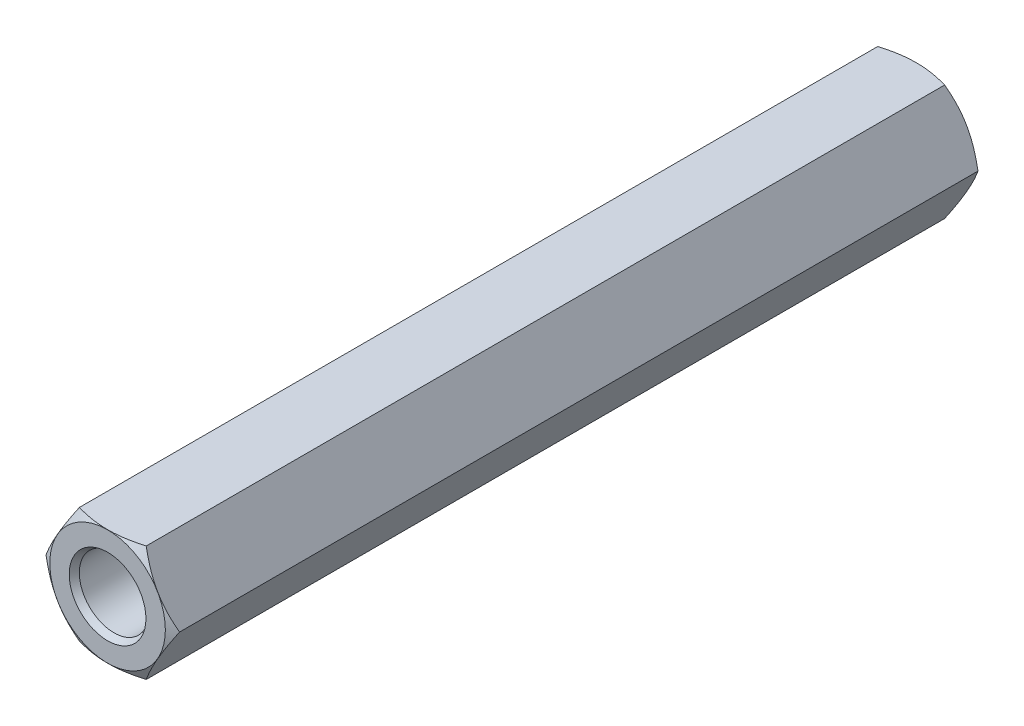
ISO-10303-21;
HEADER;
FILE_DESCRIPTION(('STEP AP214'),'2;1');
FILE_NAME('part.step','',(''),(''),'','','');
FILE_SCHEMA(('AUTOMOTIVE_DESIGN { 1 0 10303 214 1 1 1 1 }'));
ENDSEC;
DATA;
#1=APPLICATION_CONTEXT('core data for automotive mechanical design processes');
#2=APPLICATION_PROTOCOL_DEFINITION('international standard','automotive_design',2000,#1);
#3=PRODUCT_CONTEXT('',#1,'mechanical');
#4=PRODUCT('Part','Part','',(#3));
#5=PRODUCT_RELATED_PRODUCT_CATEGORY('part','',(#4));
#6=PRODUCT_DEFINITION_FORMATION('','',#4);
#7=PRODUCT_DEFINITION_CONTEXT('part definition',#1,'design');
#8=PRODUCT_DEFINITION('design','',#6,#7);
#9=PRODUCT_DEFINITION_SHAPE('','',#8);
#10=(LENGTH_UNIT() NAMED_UNIT(*) SI_UNIT(.MILLI.,.METRE.));
#11=(NAMED_UNIT(*) PLANE_ANGLE_UNIT() SI_UNIT($,.RADIAN.));
#12=(NAMED_UNIT(*) SI_UNIT($,.STERADIAN.) SOLID_ANGLE_UNIT());
#13=UNCERTAINTY_MEASURE_WITH_UNIT(LENGTH_MEASURE(1.E-05),#10,'distance_accuracy_value','');
#14=(GEOMETRIC_REPRESENTATION_CONTEXT(3) GLOBAL_UNCERTAINTY_ASSIGNED_CONTEXT((#13)) GLOBAL_UNIT_ASSIGNED_CONTEXT((#10,
#11,#12)) REPRESENTATION_CONTEXT('',''));
#15=CARTESIAN_POINT('',(0.,0.,0.));
#16=DIRECTION('',(0.,0.,1.));
#17=DIRECTION('',(1.,0.,0.));
#18=AXIS2_PLACEMENT_3D('',#15,#16,#17);
#19=CARTESIAN_POINT('',(0.,0.,25.));
#20=DIRECTION('',(0.,0.,1.));
#21=DIRECTION('',(1.,0.,0.));
#22=AXIS2_PLACEMENT_3D('',#19,#20,#21);
#23=CONICAL_SURFACE('',#22,1.5,1.047197551197);
#24=CARTESIAN_POINT('',(0.,0.,25.));
#25=DIRECTION('',(0.,0.,1.));
#26=DIRECTION('',(1.,0.,0.));
#27=AXIS2_PLACEMENT_3D('',#24,#25,#26);
#28=CIRCLE('',#27,1.5);
#29=CARTESIAN_POINT('',(1.5,0.,25.));
#30=VERTEX_POINT('',#29);
#31=EDGE_CURVE('E29',#30,#30,#28,.T.);
#32=ORIENTED_EDGE('',*,*,#31,.T.);
#33=DIRECTION('',(-0.866025403784329,0.,-0.50000000000019));
#34=VECTOR('',#33,1.);
#35=CARTESIAN_POINT('',(1.5,0.,25.));
#36=LINE('',#35,#34);
#37=CARTESIAN_POINT('',(0.,0.,24.133974596216));
#38=VERTEX_POINT('',#37);
#39=EDGE_CURVE('E10',#30,#38,#36,.T.);
#40=ORIENTED_EDGE('',*,*,#39,.T.);
#41=ORIENTED_EDGE('',*,*,#39,.F.);
#42=EDGE_LOOP('',(#32,#40,#41));
#43=FACE_BOUND('',#42,.T.);
#44=ADVANCED_FACE('F16',(#43),#23,.F.);
#45=CARTESIAN_POINT('',(0.,0.,34.722871870789));
#46=DIRECTION('',(0.,0.,-1.));
#47=DIRECTION('',(1.,0.,0.));
#48=AXIS2_PLACEMENT_3D('',#45,#46,#47);
#49=CYLINDRICAL_SURFACE('',#48,1.5);
#50=CARTESIAN_POINT('',(0.,0.,34.722871870789));
#51=DIRECTION('',(0.,0.,1.));
#52=DIRECTION('',(1.,0.,0.));
#53=AXIS2_PLACEMENT_3D('',#50,#51,#52);
#54=CIRCLE('',#53,1.5);
#55=CARTESIAN_POINT('',(1.5,0.,34.722871870789));
#56=VERTEX_POINT('',#55);
#57=EDGE_CURVE('E144',#56,#56,#54,.T.);
#58=ORIENTED_EDGE('',*,*,#57,.T.);
#59=DIRECTION('',(0.,0.,-1.));
#60=VECTOR('',#59,1.);
#61=CARTESIAN_POINT('',(1.5,0.,34.722871870789));
#62=LINE('',#61,#60);
#63=EDGE_CURVE('E134',#56,#30,#62,.T.);
#64=ORIENTED_EDGE('',*,*,#63,.T.);
#65=ORIENTED_EDGE('',*,*,#31,.F.);
#66=ORIENTED_EDGE('',*,*,#63,.F.);
#67=EDGE_LOOP('',(#58,#64,#65,#66));
#68=FACE_BOUND('',#67,.T.);
#69=ADVANCED_FACE('F315',(#68),#49,.F.);
#70=CARTESIAN_POINT('',(0.,0.,35.));
#71=DIRECTION('',(0.,0.,1.));
#72=DIRECTION('',(1.,0.,0.));
#73=AXIS2_PLACEMENT_3D('',#70,#71,#72);
#74=CONICAL_SURFACE('',#73,1.66,0.523598775598);
#75=CARTESIAN_POINT('',(0.,0.,35.));
#76=DIRECTION('',(0.,0.,1.));
#77=DIRECTION('',(1.,0.,0.));
#78=AXIS2_PLACEMENT_3D('',#75,#76,#77);
#79=CIRCLE('',#78,1.66);
#80=CARTESIAN_POINT('',(1.66,0.,35.));
#81=VERTEX_POINT('',#80);
#82=EDGE_CURVE('E143',#81,#81,#79,.T.);
#83=ORIENTED_EDGE('',*,*,#82,.T.);
#84=DIRECTION('',(-0.50000000000019,0.,-0.866025403784329));
#85=VECTOR('',#84,1.);
#86=CARTESIAN_POINT('',(1.66,0.,35.));
#87=LINE('',#86,#85);
#88=EDGE_CURVE('E141',#81,#56,#87,.T.);
#89=ORIENTED_EDGE('',*,*,#88,.T.);
#90=ORIENTED_EDGE('',*,*,#57,.F.);
#91=ORIENTED_EDGE('',*,*,#88,.F.);
#92=EDGE_LOOP('',(#83,#89,#90,#91));
#93=FACE_BOUND('',#92,.T.);
#94=ADVANCED_FACE('F18',(#93),#74,.F.);
#95=CARTESIAN_POINT('',(0.,0.,35.));
#96=DIRECTION('',(0.,0.,1.));
#97=DIRECTION('',(1.,0.,0.));
#98=AXIS2_PLACEMENT_3D('',#95,#96,#97);
#99=PLANE('',#98);
#100=ORIENTED_EDGE('',*,*,#82,.F.);
#101=EDGE_LOOP('',(#100));
#102=FACE_BOUND('',#101,.T.);
#103=CARTESIAN_POINT('',(0.,0.,35.));
#104=DIRECTION('',(0.,0.,1.));
#105=DIRECTION('',(1.,0.,0.));
#106=AXIS2_PLACEMENT_3D('',#103,#104,#105);
#107=CIRCLE('',#106,2.5);
#108=CARTESIAN_POINT('',(2.5,0.,35.));
#109=VERTEX_POINT('',#108);
#110=EDGE_CURVE('E153',#109,#109,#107,.T.);
#111=ORIENTED_EDGE('',*,*,#110,.T.);
#112=EDGE_LOOP('',(#111));
#113=FACE_BOUND('',#112,.T.);
#114=ADVANCED_FACE('F314',(#102,#113),#99,.T.);
#115=CARTESIAN_POINT('',(0.,0.,34.774833395016));
#116=DIRECTION('',(0.,0.,-1.));
#117=DIRECTION('',(1.,0.,0.));
#118=AXIS2_PLACEMENT_3D('',#115,#116,#117);
#119=CONICAL_SURFACE('',#118,2.89,1.047197551197);
#120=CARTESIAN_POINT('',(2.89000000000102,6.50590692430342E-13,34.7748333950154));
#121=CARTESIAN_POINT('',(2.16750000000037,-1.25140670846835,35.1919689645057));
#122=CARTESIAN_POINT('',(1.44499999999998,-2.50281341693691,34.774833395016));
#123=(BOUNDED_CURVE() B_SPLINE_CURVE(2,(#120,#121,#122),.UNSPECIFIED.,.F.,
.F.) B_SPLINE_CURVE_WITH_KNOTS((3,3),(0.,1.),
.UNSPECIFIED.) CURVE() GEOMETRIC_REPRESENTATION_ITEM() RATIONAL_B_SPLINE_CURVE((1.,
1.15470053837948,1.)) REPRESENTATION_ITEM(''));
#124=CARTESIAN_POINT('',(2.89,0.,34.774833395016));
#125=VERTEX_POINT('',#124);
#126=CARTESIAN_POINT('',(1.445,-2.502813416937,34.774833395016));
#127=VERTEX_POINT('',#126);
#128=EDGE_CURVE('E158',#125,#127,#123,.T.);
#129=ORIENTED_EDGE('',*,*,#128,.F.);
#130=DIRECTION('',(-0.866025403784329,0.,0.50000000000019));
#131=VECTOR('',#130,1.);
#132=CARTESIAN_POINT('',(2.89,0.,34.774833395016));
#133=LINE('',#132,#131);
#134=EDGE_CURVE('E162',#125,#109,#133,.T.);
#135=ORIENTED_EDGE('',*,*,#134,.T.);
#136=ORIENTED_EDGE('',*,*,#110,.F.);
#137=ORIENTED_EDGE('',*,*,#134,.F.);
#138=CARTESIAN_POINT('',(1.44499999999985,2.50281341693714,34.7748333950159));
#139=CARTESIAN_POINT('',(2.16750000000006,1.2514067084689,35.1919689645056));
#140=CARTESIAN_POINT('',(2.89000000000031,5.90194559890733E-13,34.7748333950158));
#141=(BOUNDED_CURVE() B_SPLINE_CURVE(2,(#138,#139,#140),.UNSPECIFIED.,.F.,
.F.) B_SPLINE_CURVE_WITH_KNOTS((3,3),(0.,1.),
.UNSPECIFIED.) CURVE() GEOMETRIC_REPRESENTATION_ITEM() RATIONAL_B_SPLINE_CURVE((1.,
1.15470053837938,1.)) REPRESENTATION_ITEM(''));
#142=CARTESIAN_POINT('',(1.445,2.502813416937,34.774833395016));
#143=VERTEX_POINT('',#142);
#144=EDGE_CURVE('E263',#143,#125,#141,.T.);
#145=ORIENTED_EDGE('',*,*,#144,.F.);
#146=CARTESIAN_POINT('',(-1.44500000000009,2.502813416937,34.774833395016));
#147=CARTESIAN_POINT('',(0.,2.502813416937,35.1919689645055));
#148=CARTESIAN_POINT('',(1.44499999999997,2.502813416937,34.774833395016));
#149=(BOUNDED_CURVE() B_SPLINE_CURVE(2,(#146,#147,#148),.UNSPECIFIED.,.F.,
.F.) B_SPLINE_CURVE_WITH_KNOTS((3,3),(0.,1.),
.UNSPECIFIED.) CURVE() GEOMETRIC_REPRESENTATION_ITEM() RATIONAL_B_SPLINE_CURVE((1.,
1.15470053837922,1.)) REPRESENTATION_ITEM(''));
#150=CARTESIAN_POINT('',(-1.445,2.502813416937,34.774833395016));
#151=VERTEX_POINT('',#150);
#152=EDGE_CURVE('E63',#151,#143,#149,.T.);
#153=ORIENTED_EDGE('',*,*,#152,.F.);
#154=CARTESIAN_POINT('',(-2.89000000000109,-7.58282325818982E-13,34.7748333950153));
#155=CARTESIAN_POINT('',(-2.1675000000004,1.25140670846831,35.1919689645057));
#156=CARTESIAN_POINT('',(-1.44499999999998,2.50281341693691,34.774833395016));
#157=(BOUNDED_CURVE() B_SPLINE_CURVE(2,(#154,#155,#156),.UNSPECIFIED.,.F.,
.F.) B_SPLINE_CURVE_WITH_KNOTS((3,3),(0.,1.),
.UNSPECIFIED.) CURVE() GEOMETRIC_REPRESENTATION_ITEM() RATIONAL_B_SPLINE_CURVE((1.,
1.15470053837948,1.)) REPRESENTATION_ITEM(''));
#158=CARTESIAN_POINT('',(-2.89,0.,34.774833395016));
#159=VERTEX_POINT('',#158);
#160=EDGE_CURVE('E20',#159,#151,#157,.T.);
#161=ORIENTED_EDGE('',*,*,#160,.F.);
#162=CARTESIAN_POINT('',(-1.44499999999985,-2.50281341693714,34.7748333950159));
#163=CARTESIAN_POINT('',(-2.16750000000005,-1.25140670846891,35.1919689645056));
#164=CARTESIAN_POINT('',(-2.89000000000029,-6.26165785888588E-13,34.7748333950158));
#165=(BOUNDED_CURVE() B_SPLINE_CURVE(2,(#162,#163,#164),.UNSPECIFIED.,.F.,
.F.) B_SPLINE_CURVE_WITH_KNOTS((3,3),(0.,1.),
.UNSPECIFIED.) CURVE() GEOMETRIC_REPRESENTATION_ITEM() RATIONAL_B_SPLINE_CURVE((1.,
1.15470053837934,1.)) REPRESENTATION_ITEM(''));
#166=CARTESIAN_POINT('',(-1.445,-2.502813416937,34.774833395016));
#167=VERTEX_POINT('',#166);
#168=EDGE_CURVE('E108',#167,#159,#165,.T.);
#169=ORIENTED_EDGE('',*,*,#168,.F.);
#170=CARTESIAN_POINT('',(1.44500000000009,-2.502813416937,34.774833395016));
#171=CARTESIAN_POINT('',(0.,-2.502813416937,35.1919689645055));
#172=CARTESIAN_POINT('',(-1.44499999999997,-2.502813416937,34.774833395016));
#173=(BOUNDED_CURVE() B_SPLINE_CURVE(2,(#170,#171,#172),.UNSPECIFIED.,.F.,
.F.) B_SPLINE_CURVE_WITH_KNOTS((3,3),(0.,1.),
.UNSPECIFIED.) CURVE() GEOMETRIC_REPRESENTATION_ITEM() RATIONAL_B_SPLINE_CURVE((1.,
1.15470053837924,1.)) REPRESENTATION_ITEM(''));
#174=EDGE_CURVE('E93',#127,#167,#173,.T.);
#175=ORIENTED_EDGE('',*,*,#174,.F.);
#176=EDGE_LOOP('',(#129,#135,#136,#137,#145,#153,#161,#169,#175));
#177=FACE_BOUND('',#176,.T.);
#178=ADVANCED_FACE('F330',(#177),#119,.T.);
#179=CARTESIAN_POINT('',(1.445,-2.502813416937,0.));
#180=DIRECTION('',(-0.866025403784329,0.50000000000019,0.));
#181=DIRECTION('',(0.,0.,1.));
#182=AXIS2_PLACEMENT_3D('',#179,#180,#181);
#183=PLANE('',#182);
#184=DIRECTION('',(0.,0.,1.));
#185=VECTOR('',#184,1.);
#186=CARTESIAN_POINT('',(2.89,0.,0.225166604984));
#187=LINE('',#186,#185);
#188=CARTESIAN_POINT('',(2.89,0.,0.225166604984));
#189=VERTEX_POINT('',#188);
#190=EDGE_CURVE('E251',#189,#125,#187,.T.);
#191=ORIENTED_EDGE('',*,*,#190,.T.);
#192=ORIENTED_EDGE('',*,*,#128,.T.);
#193=DIRECTION('',(0.,0.,1.));
#194=VECTOR('',#193,1.);
#195=CARTESIAN_POINT('',(1.445,-2.502813416937,0.));
#196=LINE('',#195,#194);
#197=CARTESIAN_POINT('',(1.445,-2.502813416937,0.225166604984));
#198=VERTEX_POINT('',#197);
#199=EDGE_CURVE('E238',#198,#127,#196,.T.);
#200=ORIENTED_EDGE('',*,*,#199,.F.);
#201=CARTESIAN_POINT('',(1.44499999999986,-2.50281341693713,0.225166604984106));
#202=CARTESIAN_POINT('',(2.16750000000006,-1.25140670846889,-0.191968964505588));
#203=CARTESIAN_POINT('',(2.89000000000031,-5.83089132533132E-13,0.225166604984202));
#204=(BOUNDED_CURVE() B_SPLINE_CURVE(2,(#201,#202,#203),.UNSPECIFIED.,.F.,
.F.) B_SPLINE_CURVE_WITH_KNOTS((3,3),(0.,1.),
.UNSPECIFIED.) CURVE() GEOMETRIC_REPRESENTATION_ITEM() RATIONAL_B_SPLINE_CURVE((1.,
1.15470053837935,1.)) REPRESENTATION_ITEM(''));
#205=EDGE_CURVE('E173',#198,#189,#204,.T.);
#206=ORIENTED_EDGE('',*,*,#205,.T.);
#207=EDGE_LOOP('',(#191,#192,#200,#206));
#208=FACE_BOUND('',#207,.T.);
#209=ADVANCED_FACE('F324',(#208),#183,.F.);
#210=CARTESIAN_POINT('',(-1.445,-2.502813416937,0.));
#211=DIRECTION('',(0.,1.,0.));
#212=DIRECTION('',(1.,0.,0.));
#213=AXIS2_PLACEMENT_3D('',#210,#211,#212);
#214=PLANE('',#213);
#215=ORIENTED_EDGE('',*,*,#199,.T.);
#216=ORIENTED_EDGE('',*,*,#174,.T.);
#217=DIRECTION('',(0.,0.,1.));
#218=VECTOR('',#217,1.);
#219=CARTESIAN_POINT('',(-1.445,-2.502813416937,0.));
#220=LINE('',#219,#218);
#221=CARTESIAN_POINT('',(-1.445,-2.502813416937,0.225166604984));
#222=VERTEX_POINT('',#221);
#223=EDGE_CURVE('E239',#222,#167,#220,.T.);
#224=ORIENTED_EDGE('',*,*,#223,.F.);
#225=CARTESIAN_POINT('',(-1.44500000000008,-2.502813416937,0.225166604984046));
#226=CARTESIAN_POINT('',(0.,-2.50281341693701,-0.191968964505495));
#227=CARTESIAN_POINT('',(1.44499999999997,-2.502813416937,0.225166604984016));
#228=(BOUNDED_CURVE() B_SPLINE_CURVE(2,(#225,#226,#227),.UNSPECIFIED.,.F.,
.F.) B_SPLINE_CURVE_WITH_KNOTS((3,3),(0.,1.),
.UNSPECIFIED.) CURVE() GEOMETRIC_REPRESENTATION_ITEM() RATIONAL_B_SPLINE_CURVE((1.,
1.15470053837926,1.)) REPRESENTATION_ITEM(''));
#229=EDGE_CURVE('E163',#222,#198,#228,.T.);
#230=ORIENTED_EDGE('',*,*,#229,.T.);
#231=EDGE_LOOP('',(#215,#216,#224,#230));
#232=FACE_BOUND('',#231,.T.);
#233=ADVANCED_FACE('F329',(#232),#214,.F.);
#234=CARTESIAN_POINT('',(-2.89,0.,0.));
#235=DIRECTION('',(0.866025403784329,0.50000000000019,0.));
#236=DIRECTION('',(0.,0.,-1.));
#237=AXIS2_PLACEMENT_3D('',#234,#235,#236);
#238=PLANE('',#237);
#239=ORIENTED_EDGE('',*,*,#223,.T.);
#240=ORIENTED_EDGE('',*,*,#168,.T.);
#241=DIRECTION('',(0.,0.,1.));
#242=VECTOR('',#241,1.);
#243=CARTESIAN_POINT('',(-2.89,0.,0.));
#244=LINE('',#243,#242);
#245=CARTESIAN_POINT('',(-2.89,0.,0.225166604984));
#246=VERTEX_POINT('',#245);
#247=EDGE_CURVE('E187',#246,#159,#244,.T.);
#248=ORIENTED_EDGE('',*,*,#247,.F.);
#249=CARTESIAN_POINT('',(-2.89000000000094,5.09592368302947E-13,0.225166604984566));
#250=CARTESIAN_POINT('',(-2.16750000000034,-1.2514067084684,-0.191968964505698));
#251=CARTESIAN_POINT('',(-1.44499999999998,-2.50281341693691,0.225166604984036));
#252=(BOUNDED_CURVE() B_SPLINE_CURVE(2,(#249,#250,#251),.UNSPECIFIED.,.F.,
.F.) B_SPLINE_CURVE_WITH_KNOTS((3,3),(0.,1.),
.UNSPECIFIED.) CURVE() GEOMETRIC_REPRESENTATION_ITEM() RATIONAL_B_SPLINE_CURVE((1.,
1.15470053837945,1.)) REPRESENTATION_ITEM(''));
#253=EDGE_CURVE('E172',#246,#222,#252,.T.);
#254=ORIENTED_EDGE('',*,*,#253,.T.);
#255=EDGE_LOOP('',(#239,#240,#248,#254));
#256=FACE_BOUND('',#255,.T.);
#257=ADVANCED_FACE('F371',(#256),#238,.F.);
#258=CARTESIAN_POINT('',(-1.445,2.502813416937,0.));
#259=DIRECTION('',(0.866025403784329,-0.50000000000019,0.));
#260=DIRECTION('',(0.,0.,-1.));
#261=AXIS2_PLACEMENT_3D('',#258,#259,#260);
#262=PLANE('',#261);
#263=ORIENTED_EDGE('',*,*,#247,.T.);
#264=ORIENTED_EDGE('',*,*,#160,.T.);
#265=DIRECTION('',(0.,0.,1.));
#266=VECTOR('',#265,1.);
#267=CARTESIAN_POINT('',(-1.445,2.502813416937,0.));
#268=LINE('',#267,#266);
#269=CARTESIAN_POINT('',(-1.445,2.502813416937,0.225166604984));
#270=VERTEX_POINT('',#269);
#271=EDGE_CURVE('E188',#270,#151,#268,.T.);
#272=ORIENTED_EDGE('',*,*,#271,.F.);
#273=CARTESIAN_POINT('',(-1.44499999999986,2.50281341693713,0.225166604984106));
#274=CARTESIAN_POINT('',(-2.16750000000007,1.25140670846888,-0.191968964505593));
#275=CARTESIAN_POINT('',(-2.89000000000033,5.42899059041702E-13,0.225166604984216));
#276=(BOUNDED_CURVE() B_SPLINE_CURVE(2,(#273,#274,#275),.UNSPECIFIED.,.F.,
.F.) B_SPLINE_CURVE_WITH_KNOTS((3,3),(0.,1.),
.UNSPECIFIED.) CURVE() GEOMETRIC_REPRESENTATION_ITEM() RATIONAL_B_SPLINE_CURVE((1.,
1.15470053837935,1.)) REPRESENTATION_ITEM(''));
#277=EDGE_CURVE('E197',#270,#246,#276,.T.);
#278=ORIENTED_EDGE('',*,*,#277,.T.);
#279=EDGE_LOOP('',(#263,#264,#272,#278));
#280=FACE_BOUND('',#279,.T.);
#281=ADVANCED_FACE('F402',(#280),#262,.F.);
#282=CARTESIAN_POINT('',(1.445,2.502813416937,0.));
#283=DIRECTION('',(0.,-1.,0.));
#284=DIRECTION('',(-1.,0.,0.));
#285=AXIS2_PLACEMENT_3D('',#282,#283,#284);
#286=PLANE('',#285);
#287=ORIENTED_EDGE('',*,*,#271,.T.);
#288=ORIENTED_EDGE('',*,*,#152,.T.);
#289=DIRECTION('',(0.,0.,1.));
#290=VECTOR('',#289,1.);
#291=CARTESIAN_POINT('',(1.445,2.502813416937,0.));
#292=LINE('',#291,#290);
#293=CARTESIAN_POINT('',(1.445,2.502813416937,0.225166604984));
#294=VERTEX_POINT('',#293);
#295=EDGE_CURVE('E77',#294,#143,#292,.T.);
#296=ORIENTED_EDGE('',*,*,#295,.F.);
#297=CARTESIAN_POINT('',(1.44500000000008,2.502813416937,0.225166604984046));
#298=CARTESIAN_POINT('',(0.,2.50281341693701,-0.191968964505495));
#299=CARTESIAN_POINT('',(-1.44499999999997,2.502813416937,0.225166604984016));
#300=(BOUNDED_CURVE() B_SPLINE_CURVE(2,(#297,#298,#299),.UNSPECIFIED.,.F.,
.F.) B_SPLINE_CURVE_WITH_KNOTS((3,3),(0.,1.),
.UNSPECIFIED.) CURVE() GEOMETRIC_REPRESENTATION_ITEM() RATIONAL_B_SPLINE_CURVE((1.,
1.15470053837926,1.)) REPRESENTATION_ITEM(''));
#301=EDGE_CURVE('E203',#294,#270,#300,.T.);
#302=ORIENTED_EDGE('',*,*,#301,.T.);
#303=EDGE_LOOP('',(#287,#288,#296,#302));
#304=FACE_BOUND('',#303,.T.);
#305=ADVANCED_FACE('F407',(#304),#286,.F.);
#306=CARTESIAN_POINT('',(2.89,0.,0.));
#307=DIRECTION('',(-0.866025403784329,-0.50000000000019,0.));
#308=DIRECTION('',(-0.50000000000019,0.866025403784329,0.));
#309=AXIS2_PLACEMENT_3D('',#306,#307,#308);
#310=PLANE('',#309);
#311=ORIENTED_EDGE('',*,*,#295,.T.);
#312=ORIENTED_EDGE('',*,*,#144,.T.);
#313=ORIENTED_EDGE('',*,*,#190,.F.);
#314=CARTESIAN_POINT('',(2.89000000000101,-6.28830321147689E-13,0.225166604984606));
#315=CARTESIAN_POINT('',(2.16750000000037,1.25140670846836,-0.191968964505713));
#316=CARTESIAN_POINT('',(1.44499999999998,2.50281341693691,0.225166604984036));
#317=(BOUNDED_CURVE() B_SPLINE_CURVE(2,(#314,#315,#316),.UNSPECIFIED.,.F.,
.F.) B_SPLINE_CURVE_WITH_KNOTS((3,3),(0.,1.),
.UNSPECIFIED.) CURVE() GEOMETRIC_REPRESENTATION_ITEM() RATIONAL_B_SPLINE_CURVE((1.,
1.15470053837946,1.)) REPRESENTATION_ITEM(''));
#318=EDGE_CURVE('E211',#189,#294,#317,.T.);
#319=ORIENTED_EDGE('',*,*,#318,.T.);
#320=EDGE_LOOP('',(#311,#312,#313,#319));
#321=FACE_BOUND('',#320,.T.);
#322=ADVANCED_FACE('F394',(#321),#310,.F.);
#323=CARTESIAN_POINT('',(0.,0.,0.));
#324=DIRECTION('',(0.,0.,1.));
#325=DIRECTION('',(1.,0.,0.));
#326=AXIS2_PLACEMENT_3D('',#323,#324,#325);
#327=CONICAL_SURFACE('',#326,2.5,1.047197551197);
#328=DIRECTION('',(0.866025403784329,0.,0.50000000000019));
#329=VECTOR('',#328,1.);
#330=CARTESIAN_POINT('',(2.5,0.,0.));
#331=LINE('',#330,#329);
#332=CARTESIAN_POINT('',(2.5,0.,0.));
#333=VERTEX_POINT('',#332);
#334=EDGE_CURVE('E212',#333,#189,#331,.T.);
#335=ORIENTED_EDGE('',*,*,#334,.F.);
#336=CARTESIAN_POINT('',(0.,0.,0.));
#337=DIRECTION('',(0.,0.,1.));
#338=DIRECTION('',(1.,0.,0.));
#339=AXIS2_PLACEMENT_3D('',#336,#337,#338);
#340=CIRCLE('',#339,2.5);
#341=EDGE_CURVE('E219',#333,#333,#340,.T.);
#342=ORIENTED_EDGE('',*,*,#341,.T.);
#343=ORIENTED_EDGE('',*,*,#334,.T.);
#344=ORIENTED_EDGE('',*,*,#205,.F.);
#345=ORIENTED_EDGE('',*,*,#229,.F.);
#346=ORIENTED_EDGE('',*,*,#253,.F.);
#347=ORIENTED_EDGE('',*,*,#277,.F.);
#348=ORIENTED_EDGE('',*,*,#301,.F.);
#349=ORIENTED_EDGE('',*,*,#318,.F.);
#350=EDGE_LOOP('',(#335,#342,#343,#344,#345,#346,#347,#348,#349));
#351=FACE_BOUND('',#350,.T.);
#352=ADVANCED_FACE('F383',(#351),#327,.T.);
#353=CARTESIAN_POINT('',(0.,0.,0.));
#354=DIRECTION('',(0.,0.,1.));
#355=DIRECTION('',(1.,0.,0.));
#356=AXIS2_PLACEMENT_3D('',#353,#354,#355);
#357=PLANE('',#356);
#358=ORIENTED_EDGE('',*,*,#341,.F.);
#359=EDGE_LOOP('',(#358));
#360=FACE_BOUND('',#359,.T.);
#361=CARTESIAN_POINT('',(0.,0.,0.));
#362=DIRECTION('',(0.,0.,1.));
#363=DIRECTION('',(1.,0.,0.));
#364=AXIS2_PLACEMENT_3D('',#361,#362,#363);
#365=CIRCLE('',#364,1.66);
#366=CARTESIAN_POINT('',(1.66,0.,0.));
#367=VERTEX_POINT('',#366);
#368=EDGE_CURVE('E249',#367,#367,#365,.T.);
#369=ORIENTED_EDGE('',*,*,#368,.T.);
#370=EDGE_LOOP('',(#369));
#371=FACE_BOUND('',#370,.T.);
#372=ADVANCED_FACE('F378',(#360,#371),#357,.F.);
#373=CARTESIAN_POINT('',(0.,0.,0.277128129211));
#374=DIRECTION('',(0.,0.,-1.));
#375=DIRECTION('',(1.,0.,0.));
#376=AXIS2_PLACEMENT_3D('',#373,#374,#375);
#377=CONICAL_SURFACE('',#376,1.5,0.523598775598);
#378=CARTESIAN_POINT('',(0.,0.,0.277128129211));
#379=DIRECTION('',(0.,0.,1.));
#380=DIRECTION('',(1.,0.,0.));
#381=AXIS2_PLACEMENT_3D('',#378,#379,#380);
#382=CIRCLE('',#381,1.5);
#383=CARTESIAN_POINT('',(1.5,0.,0.277128129211));
#384=VERTEX_POINT('',#383);
#385=EDGE_CURVE('E181',#384,#384,#382,.T.);
#386=ORIENTED_EDGE('',*,*,#385,.T.);
#387=DIRECTION('',(0.50000000000019,0.,-0.866025403784329));
#388=VECTOR('',#387,1.);
#389=CARTESIAN_POINT('',(1.5,0.,0.277128129211));
#390=LINE('',#389,#388);
#391=EDGE_CURVE('E157',#384,#367,#390,.T.);
#392=ORIENTED_EDGE('',*,*,#391,.T.);
#393=ORIENTED_EDGE('',*,*,#368,.F.);
#394=ORIENTED_EDGE('',*,*,#391,.F.);
#395=EDGE_LOOP('',(#386,#392,#393,#394));
#396=FACE_BOUND('',#395,.T.);
#397=ADVANCED_FACE('F351',(#396),#377,.F.);
#398=CARTESIAN_POINT('',(0.,0.,10.));
#399=DIRECTION('',(0.,0.,-1.));
#400=DIRECTION('',(1.,0.,0.));
#401=AXIS2_PLACEMENT_3D('',#398,#399,#400);
#402=CYLINDRICAL_SURFACE('',#401,1.5);
#403=CARTESIAN_POINT('',(0.,0.,10.));
#404=DIRECTION('',(0.,0.,1.));
#405=DIRECTION('',(1.,0.,0.));
#406=AXIS2_PLACEMENT_3D('',#403,#404,#405);
#407=CIRCLE('',#406,1.5);
#408=CARTESIAN_POINT('',(1.5,0.,10.));
#409=VERTEX_POINT('',#408);
#410=EDGE_CURVE('E182',#409,#409,#407,.T.);
#411=ORIENTED_EDGE('',*,*,#410,.T.);
#412=DIRECTION('',(0.,0.,-1.));
#413=VECTOR('',#412,1.);
#414=CARTESIAN_POINT('',(1.5,0.,10.));
#415=LINE('',#414,#413);
#416=EDGE_CURVE('E174',#409,#384,#415,.T.);
#417=ORIENTED_EDGE('',*,*,#416,.T.);
#418=ORIENTED_EDGE('',*,*,#385,.F.);
#419=ORIENTED_EDGE('',*,*,#416,.F.);
#420=EDGE_LOOP('',(#411,#417,#418,#419));
#421=FACE_BOUND('',#420,.T.);
#422=ADVANCED_FACE('F288',(#421),#402,.F.);
#423=CARTESIAN_POINT('',(0.,0.,9.866025403784));
#424=DIRECTION('',(0.,0.,-1.));
#425=DIRECTION('',(1.,0.,0.));
#426=AXIS2_PLACEMENT_3D('',#423,#424,#425);
#427=CONICAL_SURFACE('',#426,1.73205080757049,1.047197551197);
#428=DIRECTION('',(0.866025403784329,0.,-0.50000000000019));
#429=VECTOR('',#428,1.);
#430=CARTESIAN_POINT('',(0.,0.,10.866025403784));
#431=LINE('',#430,#429);
#432=CARTESIAN_POINT('',(0.,0.,10.866025403784));
#433=VERTEX_POINT('',#432);
#434=EDGE_CURVE('E224',#433,#409,#431,.T.);
#435=ORIENTED_EDGE('',*,*,#434,.T.);
#436=ORIENTED_EDGE('',*,*,#410,.F.);
#437=ORIENTED_EDGE('',*,*,#434,.F.);
#438=EDGE_LOOP('',(#435,#436,#437));
#439=FACE_BOUND('',#438,.T.);
#440=ADVANCED_FACE('F292',(#439),#427,.F.);
#441=CLOSED_SHELL('',(#44,#69,#94,#114,#178,#209,#233,#257,#281,#305,#322,#352,#372,#397,#422,#440));
#442=MANIFOLD_SOLID_BREP('B1',#441);
#443=ADVANCED_BREP_SHAPE_REPRESENTATION('',(#18,#442),#14);
#444=SHAPE_DEFINITION_REPRESENTATION(#9,#443);
ENDSEC;
END-ISO-10303-21;
